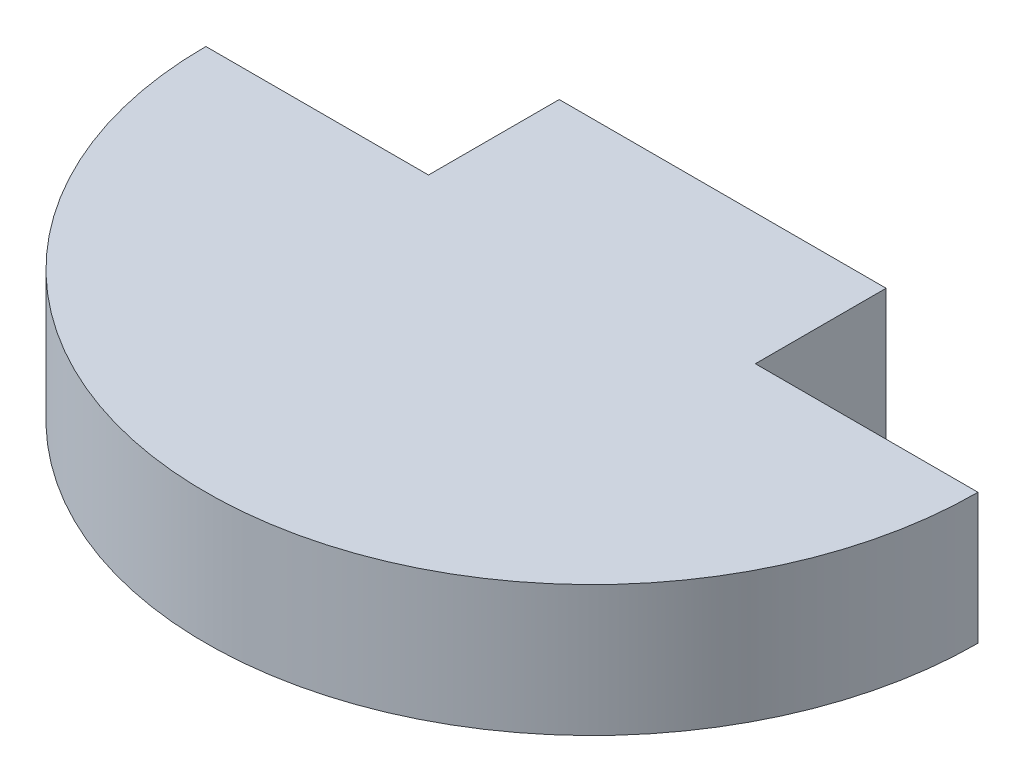
ISO-10303-21;
HEADER;
FILE_DESCRIPTION(('STEP AP214'),'2;1');
FILE_NAME('part.step','',(''),(''),'','','');
FILE_SCHEMA(('AUTOMOTIVE_DESIGN { 1 0 10303 214 1 1 1 1 }'));
ENDSEC;
DATA;
#1=APPLICATION_CONTEXT('core data for automotive mechanical design processes');
#2=APPLICATION_PROTOCOL_DEFINITION('international standard','automotive_design',2000,#1);
#3=PRODUCT_CONTEXT('',#1,'mechanical');
#4=PRODUCT('Part','Part','',(#3));
#5=PRODUCT_RELATED_PRODUCT_CATEGORY('part','',(#4));
#6=PRODUCT_DEFINITION_FORMATION('','',#4);
#7=PRODUCT_DEFINITION_CONTEXT('part definition',#1,'design');
#8=PRODUCT_DEFINITION('design','',#6,#7);
#9=PRODUCT_DEFINITION_SHAPE('','',#8);
#10=(LENGTH_UNIT() NAMED_UNIT(*) SI_UNIT(.MILLI.,.METRE.));
#11=(NAMED_UNIT(*) PLANE_ANGLE_UNIT() SI_UNIT($,.RADIAN.));
#12=(NAMED_UNIT(*) SI_UNIT($,.STERADIAN.) SOLID_ANGLE_UNIT());
#13=UNCERTAINTY_MEASURE_WITH_UNIT(LENGTH_MEASURE(1.E-05),#10,'distance_accuracy_value','');
#14=(GEOMETRIC_REPRESENTATION_CONTEXT(3) GLOBAL_UNCERTAINTY_ASSIGNED_CONTEXT((#13)) GLOBAL_UNIT_ASSIGNED_CONTEXT((#10,
#11,#12)) REPRESENTATION_CONTEXT('',''));
#15=CARTESIAN_POINT('',(0.,0.,0.));
#16=DIRECTION('',(0.,0.,1.));
#17=DIRECTION('',(1.,0.,0.));
#18=AXIS2_PLACEMENT_3D('',#15,#16,#17);
#19=CARTESIAN_POINT('',(15.,0.,0.));
#20=DIRECTION('',(0.,0.,1.));
#21=DIRECTION('',(1.,0.,0.));
#22=AXIS2_PLACEMENT_3D('',#19,#20,#21);
#23=PLANE('',#22);
#24=DIRECTION('',(0.,1.,0.));
#25=VECTOR('',#24,1.);
#26=CARTESIAN_POINT('',(-6.35,0.,0.));
#27=LINE('',#26,#25);
#28=CARTESIAN_POINT('',(-6.35,0.,0.));
#29=VERTEX_POINT('',#28);
#30=CARTESIAN_POINT('',(-6.35,5.08,0.));
#31=VERTEX_POINT('',#30);
#32=EDGE_CURVE('E140',#29,#31,#27,.T.);
#33=ORIENTED_EDGE('',*,*,#32,.F.);
#34=DIRECTION('',(1.,0.,0.));
#35=VECTOR('',#34,1.);
#36=CARTESIAN_POINT('',(0.,0.,0.));
#37=LINE('',#36,#35);
#38=CARTESIAN_POINT('',(-15.,0.,0.));
#39=VERTEX_POINT('',#38);
#40=EDGE_CURVE('E11',#39,#29,#37,.T.);
#41=ORIENTED_EDGE('',*,*,#40,.F.);
#42=DIRECTION('',(0.,-1.,0.));
#43=VECTOR('',#42,1.);
#44=CARTESIAN_POINT('',(-15.,5.08,0.));
#45=LINE('',#44,#43);
#46=CARTESIAN_POINT('',(-15.,5.08,0.));
#47=VERTEX_POINT('',#46);
#48=EDGE_CURVE('E122',#47,#39,#45,.T.);
#49=ORIENTED_EDGE('',*,*,#48,.F.);
#50=DIRECTION('',(1.,0.,0.));
#51=VECTOR('',#50,1.);
#52=CARTESIAN_POINT('',(15.,5.08,0.));
#53=LINE('',#52,#51);
#54=EDGE_CURVE('E113',#47,#31,#53,.T.);
#55=ORIENTED_EDGE('',*,*,#54,.T.);
#56=EDGE_LOOP('',(#33,#41,#49,#55));
#57=FACE_BOUND('',#56,.T.);
#58=ADVANCED_FACE('F37',(#57),#23,.F.);
#59=CARTESIAN_POINT('',(0.,5.08,0.));
#60=DIRECTION('',(0.,-1.,0.));
#61=DIRECTION('',(0.,0.,-1.));
#62=AXIS2_PLACEMENT_3D('',#59,#60,#61);
#63=CYLINDRICAL_SURFACE('',#62,15.);
#64=CARTESIAN_POINT('',(0.,5.08,0.));
#65=DIRECTION('',(0.,1.,0.));
#66=DIRECTION('',(0.,0.,1.));
#67=AXIS2_PLACEMENT_3D('',#64,#65,#66);
#68=CIRCLE('',#67,15.);
#69=CARTESIAN_POINT('',(15.,5.08,0.));
#70=VERTEX_POINT('',#69);
#71=EDGE_CURVE('E126',#47,#70,#68,.T.);
#72=ORIENTED_EDGE('',*,*,#71,.F.);
#73=ORIENTED_EDGE('',*,*,#48,.T.);
#74=CARTESIAN_POINT('',(0.,0.,0.));
#75=DIRECTION('',(0.,1.,0.));
#76=DIRECTION('',(0.,0.,1.));
#77=AXIS2_PLACEMENT_3D('',#74,#75,#76);
#78=CIRCLE('',#77,15.);
#79=CARTESIAN_POINT('',(15.,0.,0.));
#80=VERTEX_POINT('',#79);
#81=EDGE_CURVE('E125',#39,#80,#78,.T.);
#82=ORIENTED_EDGE('',*,*,#81,.T.);
#83=DIRECTION('',(0.,1.,0.));
#84=VECTOR('',#83,1.);
#85=CARTESIAN_POINT('',(15.,0.,0.));
#86=LINE('',#85,#84);
#87=EDGE_CURVE('E119',#80,#70,#86,.T.);
#88=ORIENTED_EDGE('',*,*,#87,.T.);
#89=EDGE_LOOP('',(#72,#73,#82,#88));
#90=FACE_BOUND('',#89,.T.);
#91=ADVANCED_FACE('F39',(#90),#63,.T.);
#92=CARTESIAN_POINT('',(0.,5.08,0.));
#93=DIRECTION('',(0.,1.,0.));
#94=DIRECTION('',(0.,0.,1.));
#95=AXIS2_PLACEMENT_3D('',#92,#93,#94);
#96=PLANE('',#95);
#97=ORIENTED_EDGE('',*,*,#54,.F.);
#98=ORIENTED_EDGE('',*,*,#71,.T.);
#99=CARTESIAN_POINT('',(6.35,5.08,0.));
#100=VERTEX_POINT('',#99);
#101=EDGE_CURVE('E111',#100,#70,#53,.T.);
#102=ORIENTED_EDGE('',*,*,#101,.F.);
#103=DIRECTION('',(0.,0.,1.));
#104=VECTOR('',#103,1.);
#105=CARTESIAN_POINT('',(6.35,5.08,-5.08));
#106=LINE('',#105,#104);
#107=CARTESIAN_POINT('',(6.35,5.08,-5.08));
#108=VERTEX_POINT('',#107);
#109=EDGE_CURVE('E52',#108,#100,#106,.T.);
#110=ORIENTED_EDGE('',*,*,#109,.F.);
#111=DIRECTION('',(1.,0.,0.));
#112=VECTOR('',#111,1.);
#113=CARTESIAN_POINT('',(0.,5.08,-5.08));
#114=LINE('',#113,#112);
#115=CARTESIAN_POINT('',(-6.35,5.08,-5.08));
#116=VERTEX_POINT('',#115);
#117=EDGE_CURVE('E101',#116,#108,#114,.T.);
#118=ORIENTED_EDGE('',*,*,#117,.F.);
#119=DIRECTION('',(0.,0.,1.));
#120=VECTOR('',#119,1.);
#121=CARTESIAN_POINT('',(-6.35,5.08,-5.08));
#122=LINE('',#121,#120);
#123=EDGE_CURVE('E98',#116,#31,#122,.T.);
#124=ORIENTED_EDGE('',*,*,#123,.T.);
#125=EDGE_LOOP('',(#97,#98,#102,#110,#118,#124));
#126=FACE_BOUND('',#125,.T.);
#127=ADVANCED_FACE('F134',(#126),#96,.T.);
#128=CARTESIAN_POINT('',(0.,0.,0.));
#129=DIRECTION('',(0.,1.,0.));
#130=DIRECTION('',(0.,0.,1.));
#131=AXIS2_PLACEMENT_3D('',#128,#129,#130);
#132=PLANE('',#131);
#133=ORIENTED_EDGE('',*,*,#81,.F.);
#134=ORIENTED_EDGE('',*,*,#40,.T.);
#135=DIRECTION('',(0.,0.,1.));
#136=VECTOR('',#135,1.);
#137=CARTESIAN_POINT('',(-6.35,0.,-5.08));
#138=LINE('',#137,#136);
#139=CARTESIAN_POINT('',(-6.35,0.,-5.08));
#140=VERTEX_POINT('',#139);
#141=EDGE_CURVE('E95',#140,#29,#138,.T.);
#142=ORIENTED_EDGE('',*,*,#141,.F.);
#143=DIRECTION('',(-1.,0.,0.));
#144=VECTOR('',#143,1.);
#145=CARTESIAN_POINT('',(0.,0.,-5.08));
#146=LINE('',#145,#144);
#147=CARTESIAN_POINT('',(6.35,0.,-5.08));
#148=VERTEX_POINT('',#147);
#149=EDGE_CURVE('E102',#148,#140,#146,.T.);
#150=ORIENTED_EDGE('',*,*,#149,.F.);
#151=DIRECTION('',(0.,0.,1.));
#152=VECTOR('',#151,1.);
#153=CARTESIAN_POINT('',(6.35,0.,-5.08));
#154=LINE('',#153,#152);
#155=CARTESIAN_POINT('',(6.35,0.,0.));
#156=VERTEX_POINT('',#155);
#157=EDGE_CURVE('E137',#148,#156,#154,.T.);
#158=ORIENTED_EDGE('',*,*,#157,.T.);
#159=EDGE_CURVE('E45',#156,#80,#37,.T.);
#160=ORIENTED_EDGE('',*,*,#159,.T.);
#161=EDGE_LOOP('',(#133,#134,#142,#150,#158,#160));
#162=FACE_BOUND('',#161,.T.);
#163=ADVANCED_FACE('F110',(#162),#132,.F.);
#164=ORIENTED_EDGE('',*,*,#159,.F.);
#165=DIRECTION('',(0.,1.,0.));
#166=VECTOR('',#165,1.);
#167=CARTESIAN_POINT('',(6.35,0.,0.));
#168=LINE('',#167,#166);
#169=EDGE_CURVE('E108',#156,#100,#168,.T.);
#170=ORIENTED_EDGE('',*,*,#169,.T.);
#171=ORIENTED_EDGE('',*,*,#101,.T.);
#172=ORIENTED_EDGE('',*,*,#87,.F.);
#173=EDGE_LOOP('',(#164,#170,#171,#172));
#174=FACE_BOUND('',#173,.T.);
#175=ADVANCED_FACE('F145',(#174),#23,.F.);
#176=CARTESIAN_POINT('',(-6.35,0.,-5.08));
#177=DIRECTION('',(1.,0.,0.));
#178=DIRECTION('',(0.,0.,-1.));
#179=AXIS2_PLACEMENT_3D('',#176,#177,#178);
#180=PLANE('',#179);
#181=ORIENTED_EDGE('',*,*,#32,.T.);
#182=ORIENTED_EDGE('',*,*,#123,.F.);
#183=DIRECTION('',(0.,1.,0.));
#184=VECTOR('',#183,1.);
#185=CARTESIAN_POINT('',(-6.35,0.,-5.08));
#186=LINE('',#185,#184);
#187=EDGE_CURVE('E91',#140,#116,#186,.T.);
#188=ORIENTED_EDGE('',*,*,#187,.F.);
#189=ORIENTED_EDGE('',*,*,#141,.T.);
#190=EDGE_LOOP('',(#181,#182,#188,#189));
#191=FACE_BOUND('',#190,.T.);
#192=ADVANCED_FACE('F93',(#191),#180,.F.);
#193=CARTESIAN_POINT('',(6.35,0.,-5.08));
#194=DIRECTION('',(1.,0.,0.));
#195=DIRECTION('',(0.,0.,-1.));
#196=AXIS2_PLACEMENT_3D('',#193,#194,#195);
#197=PLANE('',#196);
#198=ORIENTED_EDGE('',*,*,#169,.F.);
#199=ORIENTED_EDGE('',*,*,#157,.F.);
#200=DIRECTION('',(0.,1.,0.));
#201=VECTOR('',#200,1.);
#202=CARTESIAN_POINT('',(6.35,0.,-5.08));
#203=LINE('',#202,#201);
#204=EDGE_CURVE('E107',#148,#108,#203,.T.);
#205=ORIENTED_EDGE('',*,*,#204,.T.);
#206=ORIENTED_EDGE('',*,*,#109,.T.);
#207=EDGE_LOOP('',(#198,#199,#205,#206));
#208=FACE_BOUND('',#207,.T.);
#209=ADVANCED_FACE('F143',(#208),#197,.T.);
#210=CARTESIAN_POINT('',(0.,0.,-5.08));
#211=DIRECTION('',(0.,0.,-1.));
#212=DIRECTION('',(-1.,0.,0.));
#213=AXIS2_PLACEMENT_3D('',#210,#211,#212);
#214=PLANE('',#213);
#215=ORIENTED_EDGE('',*,*,#149,.T.);
#216=ORIENTED_EDGE('',*,*,#187,.T.);
#217=ORIENTED_EDGE('',*,*,#117,.T.);
#218=ORIENTED_EDGE('',*,*,#204,.F.);
#219=EDGE_LOOP('',(#215,#216,#217,#218));
#220=FACE_BOUND('',#219,.T.);
#221=ADVANCED_FACE('F106',(#220),#214,.T.);
#222=CLOSED_SHELL('',(#58,#91,#127,#163,#175,#192,#209,#221));
#223=MANIFOLD_SOLID_BREP('B2',#222);
#224=ADVANCED_BREP_SHAPE_REPRESENTATION('',(#18,#223),#14);
#225=SHAPE_DEFINITION_REPRESENTATION(#9,#224);
ENDSEC;
END-ISO-10303-21;
